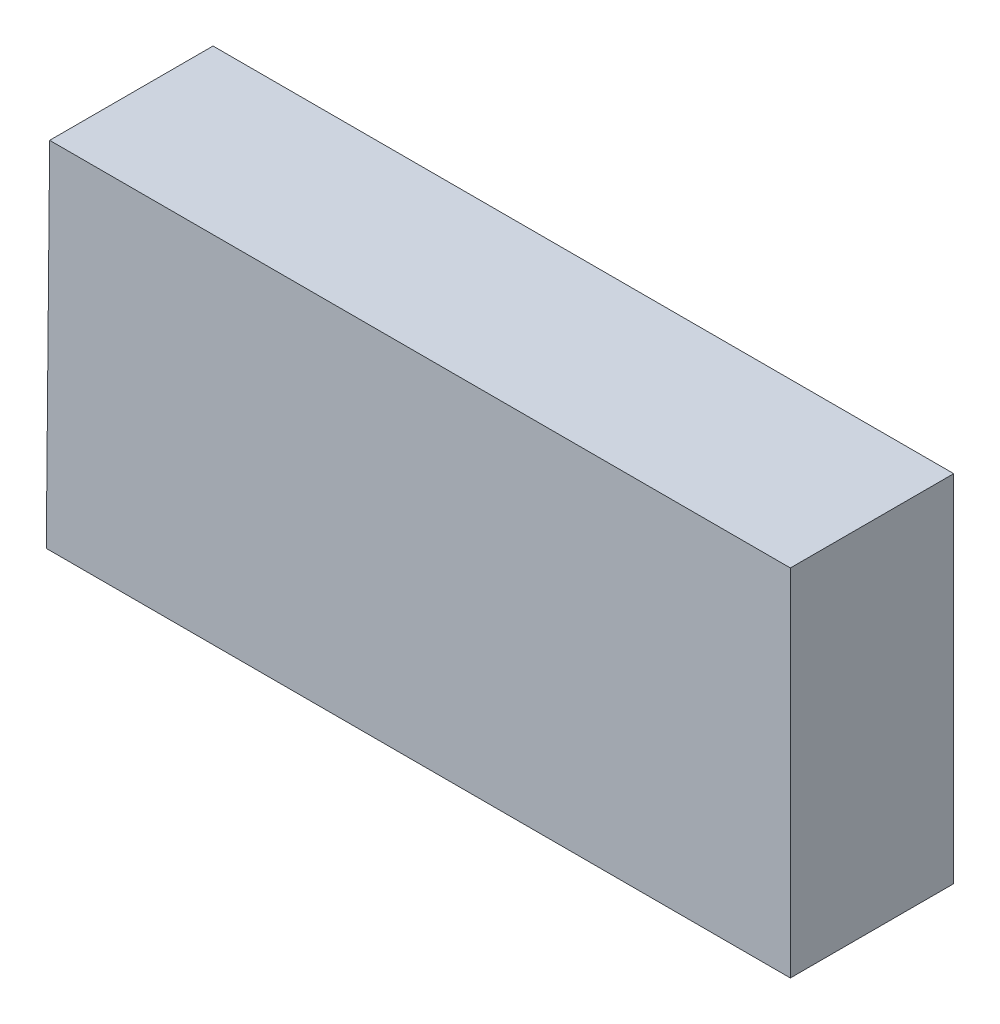
ISO-10303-21;
HEADER;
FILE_DESCRIPTION(('STEP AP214'),'2;1');
FILE_NAME('part.step','',(''),(''),'','','');
FILE_SCHEMA(('AUTOMOTIVE_DESIGN { 1 0 10303 214 1 1 1 1 }'));
ENDSEC;
DATA;
#1=APPLICATION_CONTEXT('core data for automotive mechanical design processes');
#2=APPLICATION_PROTOCOL_DEFINITION('international standard','automotive_design',2000,#1);
#3=PRODUCT_CONTEXT('',#1,'mechanical');
#4=PRODUCT('Part','Part','',(#3));
#5=PRODUCT_RELATED_PRODUCT_CATEGORY('part','',(#4));
#6=PRODUCT_DEFINITION_FORMATION('','',#4);
#7=PRODUCT_DEFINITION_CONTEXT('part definition',#1,'design');
#8=PRODUCT_DEFINITION('design','',#6,#7);
#9=PRODUCT_DEFINITION_SHAPE('','',#8);
#10=(LENGTH_UNIT() NAMED_UNIT(*) SI_UNIT(.MILLI.,.METRE.));
#11=(NAMED_UNIT(*) PLANE_ANGLE_UNIT() SI_UNIT($,.RADIAN.));
#12=(NAMED_UNIT(*) SI_UNIT($,.STERADIAN.) SOLID_ANGLE_UNIT());
#13=UNCERTAINTY_MEASURE_WITH_UNIT(LENGTH_MEASURE(1.E-05),#10,'distance_accuracy_value','');
#14=(GEOMETRIC_REPRESENTATION_CONTEXT(3) GLOBAL_UNCERTAINTY_ASSIGNED_CONTEXT((#13)) GLOBAL_UNIT_ASSIGNED_CONTEXT((#10,
#11,#12)) REPRESENTATION_CONTEXT('',''));
#15=CARTESIAN_POINT('',(0.,0.,0.));
#16=DIRECTION('',(0.,0.,1.));
#17=DIRECTION('',(1.,0.,0.));
#18=AXIS2_PLACEMENT_3D('',#15,#16,#17);
#19=CARTESIAN_POINT('',(-1.49170644,-0.71190866,0.65499996));
#20=DIRECTION('',(0.,0.,-1.));
#21=DIRECTION('',(0.,-1.,0.));
#22=AXIS2_PLACEMENT_3D('',#19,#20,#21);
#23=PLANE('',#22);
#24=DIRECTION('',(0.999999999976805,6.81099157952467E-06,0.));
#25=VECTOR('',#24,1.);
#26=CARTESIAN_POINT('',(-1.49170644,-0.71190866,0.65499996));
#27=LINE('',#26,#25);
#28=CARTESIAN_POINT('',(-1.49170644,-0.71190866,0.65499996));
#29=VERTEX_POINT('',#28);
#30=CARTESIAN_POINT('',(1.49170644,-0.71188834,0.65499996));
#31=VERTEX_POINT('',#30);
#32=EDGE_CURVE('E68',#29,#31,#27,.T.);
#33=ORIENTED_EDGE('',*,*,#32,.T.);
#34=DIRECTION('',(0.,1.,0.));
#35=VECTOR('',#34,1.);
#36=CARTESIAN_POINT('',(1.49170644,-0.71188834,0.65499996));
#37=LINE('',#36,#35);
#38=CARTESIAN_POINT('',(1.49170644,0.7119112,0.65499996));
#39=VERTEX_POINT('',#38);
#40=EDGE_CURVE('E92',#31,#39,#37,.T.);
#41=ORIENTED_EDGE('',*,*,#40,.T.);
#42=DIRECTION('',(-0.999999999990857,-4.27632592208839E-06,0.));
#43=VECTOR('',#42,1.);
#44=CARTESIAN_POINT('',(1.49170644,0.7119112,0.65499996));
#45=LINE('',#44,#43);
#46=CARTESIAN_POINT('',(-1.47813268,0.7118985,0.65499996));
#47=VERTEX_POINT('',#46);
#48=EDGE_CURVE('E70',#39,#47,#45,.T.);
#49=ORIENTED_EDGE('',*,*,#48,.T.);
#50=DIRECTION('',(-0.00953299266189855,-0.999954559993057,0.));
#51=VECTOR('',#50,1.);
#52=CARTESIAN_POINT('',(-1.47813268,0.7118985,0.65499996));
#53=LINE('',#52,#51);
#54=EDGE_CURVE('E11',#47,#29,#53,.T.);
#55=ORIENTED_EDGE('',*,*,#54,.T.);
#56=EDGE_LOOP('',(#33,#41,#49,#55));
#57=FACE_BOUND('',#56,.T.);
#58=ADVANCED_FACE('F17',(#57),#23,.F.);
#59=CARTESIAN_POINT('',(-1.49170644,-0.71190866,0.));
#60=DIRECTION('',(0.,0.,-1.));
#61=DIRECTION('',(0.,-1.,0.));
#62=AXIS2_PLACEMENT_3D('',#59,#60,#61);
#63=PLANE('',#62);
#64=DIRECTION('',(0.999999999976805,6.81099157952467E-06,0.));
#65=VECTOR('',#64,1.);
#66=CARTESIAN_POINT('',(-1.49170644,-0.71190866,0.));
#67=LINE('',#66,#65);
#68=CARTESIAN_POINT('',(-1.49170644,-0.71190866,0.));
#69=VERTEX_POINT('',#68);
#70=CARTESIAN_POINT('',(1.49170644,-0.71188834,0.));
#71=VERTEX_POINT('',#70);
#72=EDGE_CURVE('E83',#69,#71,#67,.T.);
#73=ORIENTED_EDGE('',*,*,#72,.F.);
#74=DIRECTION('',(-0.00953299266189855,-0.999954559993057,0.));
#75=VECTOR('',#74,1.);
#76=CARTESIAN_POINT('',(-1.47813268,0.7118985,0.));
#77=LINE('',#76,#75);
#78=CARTESIAN_POINT('',(-1.47813268,0.7118985,0.));
#79=VERTEX_POINT('',#78);
#80=EDGE_CURVE('E28',#79,#69,#77,.T.);
#81=ORIENTED_EDGE('',*,*,#80,.F.);
#82=DIRECTION('',(-0.999999999990857,-4.27632592208839E-06,0.));
#83=VECTOR('',#82,1.);
#84=CARTESIAN_POINT('',(1.49170644,0.7119112,0.));
#85=LINE('',#84,#83);
#86=CARTESIAN_POINT('',(1.49170644,0.7119112,0.));
#87=VERTEX_POINT('',#86);
#88=EDGE_CURVE('E110',#87,#79,#85,.T.);
#89=ORIENTED_EDGE('',*,*,#88,.F.);
#90=DIRECTION('',(0.,1.,0.));
#91=VECTOR('',#90,1.);
#92=CARTESIAN_POINT('',(1.49170644,-0.71188834,0.));
#93=LINE('',#92,#91);
#94=EDGE_CURVE('E21',#71,#87,#93,.T.);
#95=ORIENTED_EDGE('',*,*,#94,.F.);
#96=EDGE_LOOP('',(#73,#81,#89,#95));
#97=FACE_BOUND('',#96,.T.);
#98=ADVANCED_FACE('F116',(#97),#63,.T.);
#99=CARTESIAN_POINT('',(-1.47813268,0.7118985,0.));
#100=DIRECTION('',(0.999954559993057,-0.00953299266189855,0.));
#101=DIRECTION('',(0.,0.,-1.));
#102=AXIS2_PLACEMENT_3D('',#99,#100,#101);
#103=PLANE('',#102);
#104=DIRECTION('',(0.,0.,1.));
#105=VECTOR('',#104,1.);
#106=CARTESIAN_POINT('',(-1.47813268,0.7118985,0.));
#107=LINE('',#106,#105);
#108=EDGE_CURVE('E97',#79,#47,#107,.T.);
#109=ORIENTED_EDGE('',*,*,#108,.F.);
#110=ORIENTED_EDGE('',*,*,#80,.T.);
#111=DIRECTION('',(0.,0.,1.));
#112=VECTOR('',#111,1.);
#113=CARTESIAN_POINT('',(-1.49170644,-0.71190866,0.));
#114=LINE('',#113,#112);
#115=EDGE_CURVE('E76',#69,#29,#114,.T.);
#116=ORIENTED_EDGE('',*,*,#115,.T.);
#117=ORIENTED_EDGE('',*,*,#54,.F.);
#118=EDGE_LOOP('',(#109,#110,#116,#117));
#119=FACE_BOUND('',#118,.T.);
#120=ADVANCED_FACE('F19',(#119),#103,.F.);
#121=CARTESIAN_POINT('',(1.49170644,0.7119112,0.));
#122=DIRECTION('',(4.27632592208839E-06,-0.999999999990857,0.));
#123=DIRECTION('',(0.,0.,-1.));
#124=AXIS2_PLACEMENT_3D('',#121,#122,#123);
#125=PLANE('',#124);
#126=DIRECTION('',(0.,0.,1.));
#127=VECTOR('',#126,1.);
#128=CARTESIAN_POINT('',(1.49170644,0.7119112,0.));
#129=LINE('',#128,#127);
#130=EDGE_CURVE('E100',#87,#39,#129,.T.);
#131=ORIENTED_EDGE('',*,*,#130,.F.);
#132=ORIENTED_EDGE('',*,*,#88,.T.);
#133=ORIENTED_EDGE('',*,*,#108,.T.);
#134=ORIENTED_EDGE('',*,*,#48,.F.);
#135=EDGE_LOOP('',(#131,#132,#133,#134));
#136=FACE_BOUND('',#135,.T.);
#137=ADVANCED_FACE('F121',(#136),#125,.F.);
#138=CARTESIAN_POINT('',(1.49170644,-0.71188834,0.));
#139=DIRECTION('',(-1.,0.,0.));
#140=DIRECTION('',(0.,0.,1.));
#141=AXIS2_PLACEMENT_3D('',#138,#139,#140);
#142=PLANE('',#141);
#143=DIRECTION('',(0.,0.,1.));
#144=VECTOR('',#143,1.);
#145=CARTESIAN_POINT('',(1.49170644,-0.71188834,0.));
#146=LINE('',#145,#144);
#147=EDGE_CURVE('E78',#71,#31,#146,.T.);
#148=ORIENTED_EDGE('',*,*,#147,.F.);
#149=ORIENTED_EDGE('',*,*,#94,.T.);
#150=ORIENTED_EDGE('',*,*,#130,.T.);
#151=ORIENTED_EDGE('',*,*,#40,.F.);
#152=EDGE_LOOP('',(#148,#149,#150,#151));
#153=FACE_BOUND('',#152,.T.);
#154=ADVANCED_FACE('F113',(#153),#142,.F.);
#155=CARTESIAN_POINT('',(-1.49170644,-0.71190866,0.));
#156=DIRECTION('',(-6.81099157952467E-06,0.999999999976805,0.));
#157=DIRECTION('',(0.,0.,1.));
#158=AXIS2_PLACEMENT_3D('',#155,#156,#157);
#159=PLANE('',#158);
#160=ORIENTED_EDGE('',*,*,#115,.F.);
#161=ORIENTED_EDGE('',*,*,#72,.T.);
#162=ORIENTED_EDGE('',*,*,#147,.T.);
#163=ORIENTED_EDGE('',*,*,#32,.F.);
#164=EDGE_LOOP('',(#160,#161,#162,#163));
#165=FACE_BOUND('',#164,.T.);
#166=ADVANCED_FACE('F74',(#165),#159,.F.);
#167=CLOSED_SHELL('',(#58,#98,#120,#137,#154,#166));
#168=MANIFOLD_SOLID_BREP('B1',#167);
#169=ADVANCED_BREP_SHAPE_REPRESENTATION('',(#18,#168),#14);
#170=SHAPE_DEFINITION_REPRESENTATION(#9,#169);
ENDSEC;
END-ISO-10303-21;
